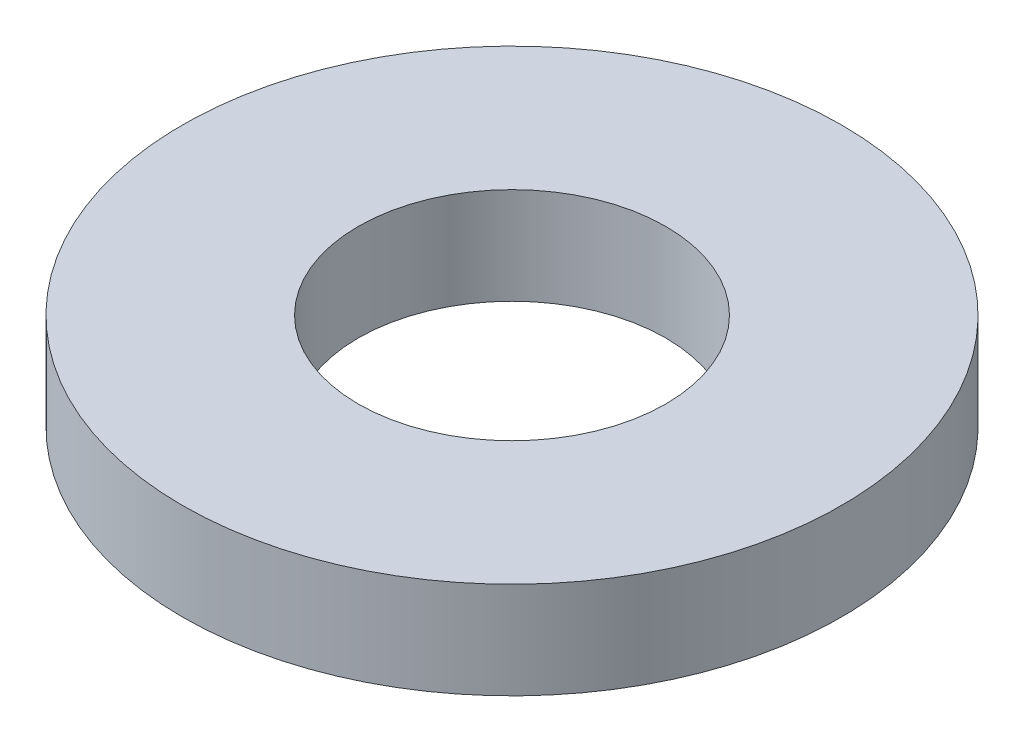
ISO-10303-21;
HEADER;
FILE_DESCRIPTION(('STEP AP214'),'2;1');
FILE_NAME('part.step','',(''),(''),'','','');
FILE_SCHEMA(('AUTOMOTIVE_DESIGN { 1 0 10303 214 1 1 1 1 }'));
ENDSEC;
DATA;
#1=APPLICATION_CONTEXT('core data for automotive mechanical design processes');
#2=APPLICATION_PROTOCOL_DEFINITION('international standard','automotive_design',2000,#1);
#3=PRODUCT_CONTEXT('',#1,'mechanical');
#4=PRODUCT('Part','Part','',(#3));
#5=PRODUCT_RELATED_PRODUCT_CATEGORY('part','',(#4));
#6=PRODUCT_DEFINITION_FORMATION('','',#4);
#7=PRODUCT_DEFINITION_CONTEXT('part definition',#1,'design');
#8=PRODUCT_DEFINITION('design','',#6,#7);
#9=PRODUCT_DEFINITION_SHAPE('','',#8);
#10=(LENGTH_UNIT() NAMED_UNIT(*) SI_UNIT(.MILLI.,.METRE.));
#11=(NAMED_UNIT(*) PLANE_ANGLE_UNIT() SI_UNIT($,.RADIAN.));
#12=(NAMED_UNIT(*) SI_UNIT($,.STERADIAN.) SOLID_ANGLE_UNIT());
#13=UNCERTAINTY_MEASURE_WITH_UNIT(LENGTH_MEASURE(1.E-05),#10,'distance_accuracy_value','');
#14=(GEOMETRIC_REPRESENTATION_CONTEXT(3) GLOBAL_UNCERTAINTY_ASSIGNED_CONTEXT((#13)) GLOBAL_UNIT_ASSIGNED_CONTEXT((#10,
#11,#12)) REPRESENTATION_CONTEXT('',''));
#15=CARTESIAN_POINT('',(0.,0.,0.));
#16=DIRECTION('',(0.,0.,1.));
#17=DIRECTION('',(1.,0.,0.));
#18=AXIS2_PLACEMENT_3D('',#15,#16,#17);
#19=CARTESIAN_POINT('',(0.,22.,0.));
#20=DIRECTION('',(0.,-1.,0.));
#21=DIRECTION('',(0.,0.,-1.));
#22=AXIS2_PLACEMENT_3D('',#19,#20,#21);
#23=CYLINDRICAL_SURFACE('',#22,75.);
#24=CARTESIAN_POINT('',(0.,22.,0.));
#25=DIRECTION('',(0.,1.,0.));
#26=DIRECTION('',(0.,0.,1.));
#27=AXIS2_PLACEMENT_3D('',#24,#25,#26);
#28=CIRCLE('',#27,75.);
#29=CARTESIAN_POINT('',(0.,22.,75.));
#30=VERTEX_POINT('',#29);
#31=EDGE_CURVE('E10',#30,#30,#28,.T.);
#32=ORIENTED_EDGE('',*,*,#31,.F.);
#33=EDGE_LOOP('',(#32));
#34=FACE_BOUND('',#33,.T.);
#35=CARTESIAN_POINT('',(0.,0.,0.));
#36=DIRECTION('',(0.,1.,0.));
#37=DIRECTION('',(0.,0.,1.));
#38=AXIS2_PLACEMENT_3D('',#35,#36,#37);
#39=CIRCLE('',#38,75.);
#40=CARTESIAN_POINT('',(0.,0.,75.));
#41=VERTEX_POINT('',#40);
#42=EDGE_CURVE('E37',#41,#41,#39,.T.);
#43=ORIENTED_EDGE('',*,*,#42,.T.);
#44=EDGE_LOOP('',(#43));
#45=FACE_BOUND('',#44,.T.);
#46=ADVANCED_FACE('F40',(#34,#45),#23,.T.);
#47=CARTESIAN_POINT('',(0.,22.,0.));
#48=DIRECTION('',(0.,1.,0.));
#49=DIRECTION('',(0.,0.,1.));
#50=AXIS2_PLACEMENT_3D('',#47,#48,#49);
#51=PLANE('',#50);
#52=CARTESIAN_POINT('',(0.,22.,0.));
#53=DIRECTION('',(0.,1.,0.));
#54=DIRECTION('',(0.,0.,1.));
#55=AXIS2_PLACEMENT_3D('',#52,#53,#54);
#56=CIRCLE('',#55,35.);
#57=CARTESIAN_POINT('',(0.,22.,35.));
#58=VERTEX_POINT('',#57);
#59=EDGE_CURVE('E50',#58,#58,#56,.T.);
#60=ORIENTED_EDGE('',*,*,#59,.F.);
#61=EDGE_LOOP('',(#60));
#62=FACE_BOUND('',#61,.T.);
#63=ORIENTED_EDGE('',*,*,#31,.T.);
#64=EDGE_LOOP('',(#63));
#65=FACE_BOUND('',#64,.T.);
#66=ADVANCED_FACE('F59',(#62,#65),#51,.T.);
#67=CARTESIAN_POINT('',(0.,0.,0.));
#68=DIRECTION('',(0.,1.,0.));
#69=DIRECTION('',(0.,0.,1.));
#70=AXIS2_PLACEMENT_3D('',#67,#68,#69);
#71=PLANE('',#70);
#72=CARTESIAN_POINT('',(0.,0.,0.));
#73=DIRECTION('',(0.,1.,0.));
#74=DIRECTION('',(0.,0.,1.));
#75=AXIS2_PLACEMENT_3D('',#72,#73,#74);
#76=CIRCLE('',#75,35.);
#77=CARTESIAN_POINT('',(0.,0.,35.));
#78=VERTEX_POINT('',#77);
#79=EDGE_CURVE('E47',#78,#78,#76,.T.);
#80=ORIENTED_EDGE('',*,*,#79,.T.);
#81=EDGE_LOOP('',(#80));
#82=FACE_BOUND('',#81,.T.);
#83=ORIENTED_EDGE('',*,*,#42,.F.);
#84=EDGE_LOOP('',(#83));
#85=FACE_BOUND('',#84,.T.);
#86=ADVANCED_FACE('F58',(#82,#85),#71,.F.);
#87=CARTESIAN_POINT('',(0.,22.,0.));
#88=DIRECTION('',(0.,-1.,0.));
#89=DIRECTION('',(0.,0.,-1.));
#90=AXIS2_PLACEMENT_3D('',#87,#88,#89);
#91=CYLINDRICAL_SURFACE('',#90,35.);
#92=ORIENTED_EDGE('',*,*,#59,.T.);
#93=EDGE_LOOP('',(#92));
#94=FACE_BOUND('',#93,.T.);
#95=ORIENTED_EDGE('',*,*,#79,.F.);
#96=EDGE_LOOP('',(#95));
#97=FACE_BOUND('',#96,.T.);
#98=ADVANCED_FACE('F54',(#94,#97),#91,.F.);
#99=CLOSED_SHELL('',(#46,#66,#86,#98));
#100=MANIFOLD_SOLID_BREP('B2',#99);
#101=ADVANCED_BREP_SHAPE_REPRESENTATION('',(#18,#100),#14);
#102=SHAPE_DEFINITION_REPRESENTATION(#9,#101);
ENDSEC;
END-ISO-10303-21;
